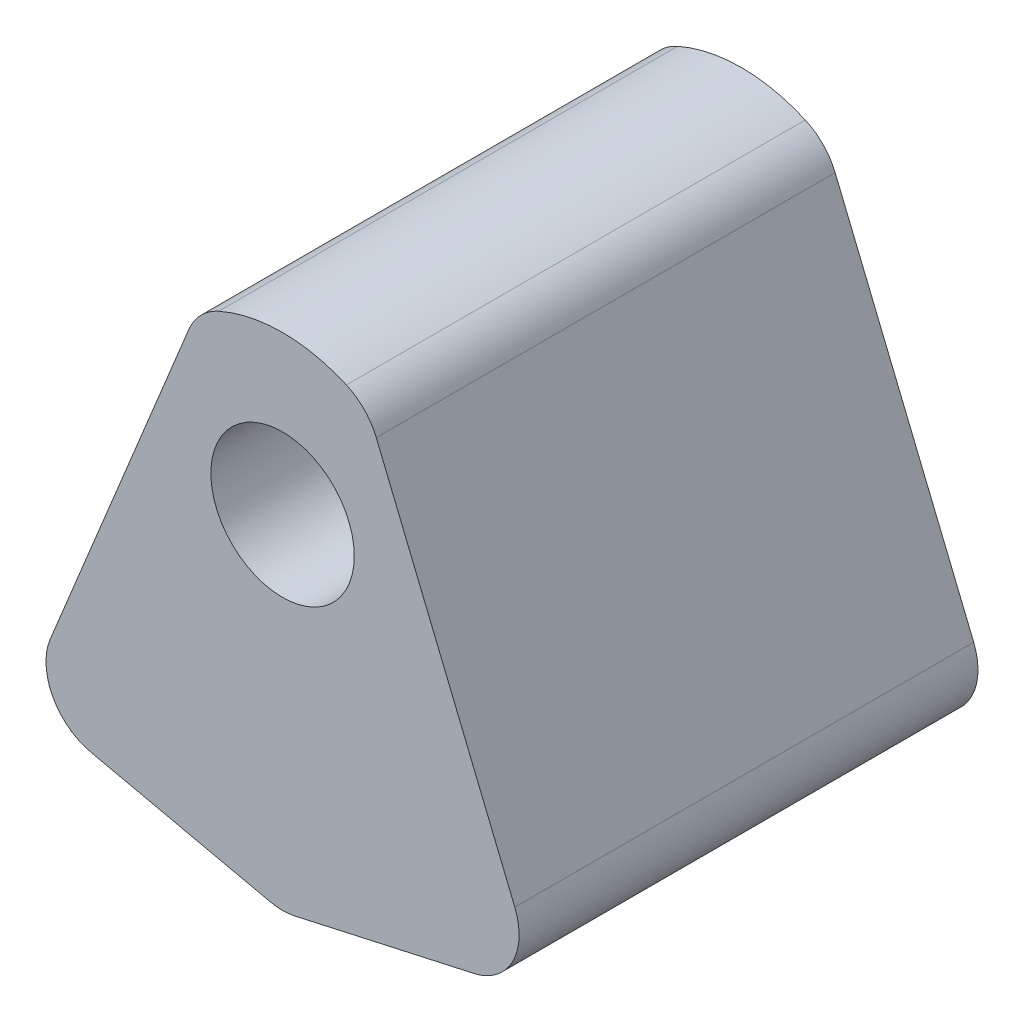
ISO-10303-21;
HEADER;
FILE_DESCRIPTION(('STEP AP214'),'2;1');
FILE_NAME('part.step','',(''),(''),'','','');
FILE_SCHEMA(('AUTOMOTIVE_DESIGN { 1 0 10303 214 1 1 1 1 }'));
ENDSEC;
DATA;
#1=APPLICATION_CONTEXT('core data for automotive mechanical design processes');
#2=APPLICATION_PROTOCOL_DEFINITION('international standard','automotive_design',2000,#1);
#3=PRODUCT_CONTEXT('',#1,'mechanical');
#4=PRODUCT('Part','Part','',(#3));
#5=PRODUCT_RELATED_PRODUCT_CATEGORY('part','',(#4));
#6=PRODUCT_DEFINITION_FORMATION('','',#4);
#7=PRODUCT_DEFINITION_CONTEXT('part definition',#1,'design');
#8=PRODUCT_DEFINITION('design','',#6,#7);
#9=PRODUCT_DEFINITION_SHAPE('','',#8);
#10=(LENGTH_UNIT() NAMED_UNIT(*) SI_UNIT(.MILLI.,.METRE.));
#11=(NAMED_UNIT(*) PLANE_ANGLE_UNIT() SI_UNIT($,.RADIAN.));
#12=(NAMED_UNIT(*) SI_UNIT($,.STERADIAN.) SOLID_ANGLE_UNIT());
#13=UNCERTAINTY_MEASURE_WITH_UNIT(LENGTH_MEASURE(1.E-05),#10,'distance_accuracy_value','');
#14=(GEOMETRIC_REPRESENTATION_CONTEXT(3) GLOBAL_UNCERTAINTY_ASSIGNED_CONTEXT((#13)) GLOBAL_UNIT_ASSIGNED_CONTEXT((#10,
#11,#12)) REPRESENTATION_CONTEXT('',''));
#15=CARTESIAN_POINT('',(0.,0.,0.));
#16=DIRECTION('',(0.,0.,1.));
#17=DIRECTION('',(1.,0.,0.));
#18=AXIS2_PLACEMENT_3D('',#15,#16,#17);
#19=CARTESIAN_POINT('',(3.12384371295259,1.71858132035534,8.));
#20=DIRECTION('',(0.,0.,-1.));
#21=DIRECTION('',(-1.,0.,0.));
#22=AXIS2_PLACEMENT_3D('',#19,#20,#21);
#23=PLANE('',#22);
#24=CARTESIAN_POINT('',(3.12384371295259,1.71858132035534,8.));
#25=DIRECTION('',(0.,0.,1.));
#26=DIRECTION('',(-1.,0.,0.));
#27=AXIS2_PLACEMENT_3D('',#24,#25,#26);
#28=CIRCLE('',#27,1.);
#29=CARTESIAN_POINT('',(3.34077417077124,0.742394260171387,8.));
#30=VERTEX_POINT('',#29);
#31=CARTESIAN_POINT('',(4.04887336974512,2.09847621905011,8.));
#32=VERTEX_POINT('',#31);
#33=EDGE_CURVE('E171',#30,#32,#28,.T.);
#34=ORIENTED_EDGE('',*,*,#33,.T.);
#35=DIRECTION('',(-0.37989489869476,0.925029656792526,0.));
#36=VECTOR('',#35,1.);
#37=CARTESIAN_POINT('',(4.04887336974512,2.09847621905011,8.));
#38=LINE('',#37,#36);
#39=CARTESIAN_POINT('',(1.63337237614125,7.98012944148705,8.));
#40=VERTEX_POINT('',#39);
#41=EDGE_CURVE('E109',#32,#40,#38,.T.);
#42=ORIENTED_EDGE('',*,*,#41,.T.);
#43=CARTESIAN_POINT('',(0.708342719348724,7.60023454279229,8.));
#44=DIRECTION('',(0.,0.,1.));
#45=DIRECTION('',(-1.,0.,0.));
#46=AXIS2_PLACEMENT_3D('',#43,#44,#45);
#47=CIRCLE('',#46,1.);
#48=CARTESIAN_POINT('',(1.113109987548,8.51465428153074,8.));
#49=VERTEX_POINT('',#48);
#50=EDGE_CURVE('E192',#40,#49,#47,.T.);
#51=ORIENTED_EDGE('',*,*,#50,.T.);
#52=CARTESIAN_POINT('',(0.,6.,8.));
#53=DIRECTION('',(0.,0.,1.));
#54=DIRECTION('',(1.,0.,0.));
#55=AXIS2_PLACEMENT_3D('',#52,#53,#54);
#56=CIRCLE('',#55,2.75);
#57=CARTESIAN_POINT('',(-1.113109987548,8.51465428153074,8.));
#58=VERTEX_POINT('',#57);
#59=EDGE_CURVE('E211',#49,#58,#56,.T.);
#60=ORIENTED_EDGE('',*,*,#59,.T.);
#61=CARTESIAN_POINT('',(-0.708342719348724,7.60023454279229,8.));
#62=DIRECTION('',(0.,0.,1.));
#63=DIRECTION('',(1.,0.,0.));
#64=AXIS2_PLACEMENT_3D('',#61,#62,#63);
#65=CIRCLE('',#64,1.);
#66=CARTESIAN_POINT('',(-1.63337237614125,7.98012944148705,8.));
#67=VERTEX_POINT('',#66);
#68=EDGE_CURVE('E208',#58,#67,#65,.T.);
#69=ORIENTED_EDGE('',*,*,#68,.T.);
#70=DIRECTION('',(-0.37989489869476,-0.925029656792526,0.));
#71=VECTOR('',#70,1.);
#72=CARTESIAN_POINT('',(-4.04887336974512,2.09847621905011,8.));
#73=LINE('',#72,#71);
#74=CARTESIAN_POINT('',(-4.04887336974512,2.09847621905011,8.));
#75=VERTEX_POINT('',#74);
#76=EDGE_CURVE('E210',#67,#75,#73,.T.);
#77=ORIENTED_EDGE('',*,*,#76,.T.);
#78=CARTESIAN_POINT('',(-3.12384371295259,1.71858132035534,8.));
#79=DIRECTION('',(0.,0.,1.));
#80=DIRECTION('',(-1.,0.,0.));
#81=AXIS2_PLACEMENT_3D('',#78,#79,#80);
#82=CIRCLE('',#81,1.);
#83=CARTESIAN_POINT('',(-3.34077417077124,0.742394260171387,8.));
#84=VERTEX_POINT('',#83);
#85=EDGE_CURVE('E134',#75,#84,#82,.T.);
#86=ORIENTED_EDGE('',*,*,#85,.T.);
#87=DIRECTION('',(0.976187060183953,-0.216930457818656,0.));
#88=VECTOR('',#87,1.);
#89=CARTESIAN_POINT('',(-0.21693045781866,0.0482067684041466,8.));
#90=LINE('',#89,#88);
#91=CARTESIAN_POINT('',(-0.21693045781866,0.0482067684041466,8.));
#92=VERTEX_POINT('',#91);
#93=EDGE_CURVE('E128',#84,#92,#90,.T.);
#94=ORIENTED_EDGE('',*,*,#93,.T.);
#95=CARTESIAN_POINT('',(0.,1.0243938285881,8.));
#96=DIRECTION('',(0.,0.,1.));
#97=DIRECTION('',(-1.,0.,0.));
#98=AXIS2_PLACEMENT_3D('',#95,#96,#97);
#99=CIRCLE('',#98,1.);
#100=CARTESIAN_POINT('',(0.21693045781866,0.0482067684041467,8.));
#101=VERTEX_POINT('',#100);
#102=EDGE_CURVE('E132',#92,#101,#99,.T.);
#103=ORIENTED_EDGE('',*,*,#102,.T.);
#104=DIRECTION('',(0.976187060183953,0.216930457818656,0.));
#105=VECTOR('',#104,1.);
#106=CARTESIAN_POINT('',(0.21693045781866,0.0482067684041466,8.));
#107=LINE('',#106,#105);
#108=EDGE_CURVE('E60',#101,#30,#107,.T.);
#109=ORIENTED_EDGE('',*,*,#108,.T.);
#110=EDGE_LOOP('',(#34,#42,#51,#60,#69,#77,#86,#94,#103,#109));
#111=FACE_BOUND('',#110,.T.);
#112=CARTESIAN_POINT('',(0.,6.,8.));
#113=DIRECTION('',(0.,0.,1.));
#114=DIRECTION('',(1.,0.,0.));
#115=AXIS2_PLACEMENT_3D('',#112,#113,#114);
#116=CIRCLE('',#115,1.25);
#117=CARTESIAN_POINT('',(1.25,6.,8.));
#118=VERTEX_POINT('',#117);
#119=EDGE_CURVE('E156',#118,#118,#116,.T.);
#120=ORIENTED_EDGE('',*,*,#119,.F.);
#121=EDGE_LOOP('',(#120));
#122=FACE_BOUND('',#121,.T.);
#123=ADVANCED_FACE('F43',(#111,#122),#23,.F.);
#124=CARTESIAN_POINT('',(3.12384371295259,1.71858132035534,0.));
#125=DIRECTION('',(0.,0.,-1.));
#126=DIRECTION('',(-1.,0.,0.));
#127=AXIS2_PLACEMENT_3D('',#124,#125,#126);
#128=PLANE('',#127);
#129=CARTESIAN_POINT('',(3.12384371295259,1.71858132035534,0.));
#130=DIRECTION('',(0.,0.,1.));
#131=DIRECTION('',(-1.,0.,0.));
#132=AXIS2_PLACEMENT_3D('',#129,#130,#131);
#133=CIRCLE('',#132,1.);
#134=CARTESIAN_POINT('',(3.34077417077124,0.742394260171387,0.));
#135=VERTEX_POINT('',#134);
#136=CARTESIAN_POINT('',(4.04887336974512,2.09847621905011,0.));
#137=VERTEX_POINT('',#136);
#138=EDGE_CURVE('E152',#135,#137,#133,.T.);
#139=ORIENTED_EDGE('',*,*,#138,.F.);
#140=DIRECTION('',(0.976187060183953,0.216930457818656,0.));
#141=VECTOR('',#140,1.);
#142=CARTESIAN_POINT('',(0.21693045781866,0.0482067684041466,0.));
#143=LINE('',#142,#141);
#144=CARTESIAN_POINT('',(0.21693045781866,0.0482067684041467,0.));
#145=VERTEX_POINT('',#144);
#146=EDGE_CURVE('E101',#145,#135,#143,.T.);
#147=ORIENTED_EDGE('',*,*,#146,.F.);
#148=CARTESIAN_POINT('',(0.,1.0243938285881,0.));
#149=DIRECTION('',(0.,0.,1.));
#150=DIRECTION('',(-1.,0.,0.));
#151=AXIS2_PLACEMENT_3D('',#148,#149,#150);
#152=CIRCLE('',#151,1.);
#153=CARTESIAN_POINT('',(-0.21693045781866,0.0482067684041466,0.));
#154=VERTEX_POINT('',#153);
#155=EDGE_CURVE('E95',#154,#145,#152,.T.);
#156=ORIENTED_EDGE('',*,*,#155,.F.);
#157=DIRECTION('',(0.976187060183953,-0.216930457818656,0.));
#158=VECTOR('',#157,1.);
#159=CARTESIAN_POINT('',(-0.21693045781866,0.0482067684041466,0.));
#160=LINE('',#159,#158);
#161=CARTESIAN_POINT('',(-3.34077417077124,0.742394260171387,0.));
#162=VERTEX_POINT('',#161);
#163=EDGE_CURVE('E142',#162,#154,#160,.T.);
#164=ORIENTED_EDGE('',*,*,#163,.F.);
#165=CARTESIAN_POINT('',(-3.12384371295259,1.71858132035534,0.));
#166=DIRECTION('',(0.,0.,1.));
#167=DIRECTION('',(-1.,0.,0.));
#168=AXIS2_PLACEMENT_3D('',#165,#166,#167);
#169=CIRCLE('',#168,1.);
#170=CARTESIAN_POINT('',(-4.04887336974512,2.09847621905011,0.));
#171=VERTEX_POINT('',#170);
#172=EDGE_CURVE('E166',#171,#162,#169,.T.);
#173=ORIENTED_EDGE('',*,*,#172,.F.);
#174=DIRECTION('',(-0.37989489869476,-0.925029656792526,0.));
#175=VECTOR('',#174,1.);
#176=CARTESIAN_POINT('',(-4.04887336974512,2.09847621905011,0.));
#177=LINE('',#176,#175);
#178=CARTESIAN_POINT('',(-1.63337237614125,7.98012944148705,0.));
#179=VERTEX_POINT('',#178);
#180=EDGE_CURVE('E164',#179,#171,#177,.T.);
#181=ORIENTED_EDGE('',*,*,#180,.F.);
#182=CARTESIAN_POINT('',(-0.708342719348724,7.60023454279229,0.));
#183=DIRECTION('',(0.,0.,1.));
#184=DIRECTION('',(1.,0.,0.));
#185=AXIS2_PLACEMENT_3D('',#182,#183,#184);
#186=CIRCLE('',#185,1.);
#187=CARTESIAN_POINT('',(-1.113109987548,8.51465428153074,0.));
#188=VERTEX_POINT('',#187);
#189=EDGE_CURVE('E162',#188,#179,#186,.T.);
#190=ORIENTED_EDGE('',*,*,#189,.F.);
#191=CARTESIAN_POINT('',(0.,6.,0.));
#192=DIRECTION('',(0.,0.,1.));
#193=DIRECTION('',(1.,0.,0.));
#194=AXIS2_PLACEMENT_3D('',#191,#192,#193);
#195=CIRCLE('',#194,2.75);
#196=CARTESIAN_POINT('',(1.113109987548,8.51465428153074,0.));
#197=VERTEX_POINT('',#196);
#198=EDGE_CURVE('E160',#197,#188,#195,.T.);
#199=ORIENTED_EDGE('',*,*,#198,.F.);
#200=CARTESIAN_POINT('',(0.708342719348724,7.60023454279229,0.));
#201=DIRECTION('',(0.,0.,1.));
#202=DIRECTION('',(-1.,0.,0.));
#203=AXIS2_PLACEMENT_3D('',#200,#201,#202);
#204=CIRCLE('',#203,1.);
#205=CARTESIAN_POINT('',(1.63337237614125,7.98012944148705,0.));
#206=VERTEX_POINT('',#205);
#207=EDGE_CURVE('E158',#206,#197,#204,.T.);
#208=ORIENTED_EDGE('',*,*,#207,.F.);
#209=DIRECTION('',(-0.37989489869476,0.925029656792526,0.));
#210=VECTOR('',#209,1.);
#211=CARTESIAN_POINT('',(4.04887336974512,2.09847621905011,0.));
#212=LINE('',#211,#210);
#213=EDGE_CURVE('E155',#137,#206,#212,.T.);
#214=ORIENTED_EDGE('',*,*,#213,.F.);
#215=EDGE_LOOP('',(#139,#147,#156,#164,#173,#181,#190,#199,#208,#214));
#216=FACE_BOUND('',#215,.T.);
#217=CARTESIAN_POINT('',(0.,6.,0.));
#218=DIRECTION('',(0.,0.,1.));
#219=DIRECTION('',(1.,0.,0.));
#220=AXIS2_PLACEMENT_3D('',#217,#218,#219);
#221=CIRCLE('',#220,1.25);
#222=CARTESIAN_POINT('',(1.25,6.,0.));
#223=VERTEX_POINT('',#222);
#224=EDGE_CURVE('E219',#223,#223,#221,.T.);
#225=ORIENTED_EDGE('',*,*,#224,.T.);
#226=EDGE_LOOP('',(#225));
#227=FACE_BOUND('',#226,.T.);
#228=ADVANCED_FACE('F196',(#216,#227),#128,.T.);
#229=CARTESIAN_POINT('',(3.12384371295259,1.71858132035534,8.));
#230=DIRECTION('',(0.,0.,-1.));
#231=DIRECTION('',(-1.,0.,0.));
#232=AXIS2_PLACEMENT_3D('',#229,#230,#231);
#233=CYLINDRICAL_SURFACE('',#232,1.);
#234=ORIENTED_EDGE('',*,*,#138,.T.);
#235=DIRECTION('',(0.,0.,-1.));
#236=VECTOR('',#235,1.);
#237=CARTESIAN_POINT('',(4.04887336974512,2.09847621905011,8.));
#238=LINE('',#237,#236);
#239=EDGE_CURVE('E13',#32,#137,#238,.T.);
#240=ORIENTED_EDGE('',*,*,#239,.F.);
#241=ORIENTED_EDGE('',*,*,#33,.F.);
#242=DIRECTION('',(0.,0.,-1.));
#243=VECTOR('',#242,1.);
#244=CARTESIAN_POINT('',(3.34077417077124,0.742394260171387,8.));
#245=LINE('',#244,#243);
#246=EDGE_CURVE('E148',#30,#135,#245,.T.);
#247=ORIENTED_EDGE('',*,*,#246,.T.);
#248=EDGE_LOOP('',(#234,#240,#241,#247));
#249=FACE_BOUND('',#248,.T.);
#250=ADVANCED_FACE('F45',(#249),#233,.T.);
#251=CARTESIAN_POINT('',(4.04887336974512,2.09847621905011,8.));
#252=DIRECTION('',(-0.925029656792526,-0.37989489869476,0.));
#253=DIRECTION('',(0.37989489869476,-0.925029656792526,0.));
#254=AXIS2_PLACEMENT_3D('',#251,#252,#253);
#255=PLANE('',#254);
#256=ORIENTED_EDGE('',*,*,#213,.T.);
#257=DIRECTION('',(0.,0.,-1.));
#258=VECTOR('',#257,1.);
#259=CARTESIAN_POINT('',(1.63337237614125,7.98012944148705,8.));
#260=LINE('',#259,#258);
#261=EDGE_CURVE('E52',#40,#206,#260,.T.);
#262=ORIENTED_EDGE('',*,*,#261,.F.);
#263=ORIENTED_EDGE('',*,*,#41,.F.);
#264=ORIENTED_EDGE('',*,*,#239,.T.);
#265=EDGE_LOOP('',(#256,#262,#263,#264));
#266=FACE_BOUND('',#265,.T.);
#267=ADVANCED_FACE('F255',(#266),#255,.F.);
#268=CARTESIAN_POINT('',(0.708342719348724,7.60023454279229,8.));
#269=DIRECTION('',(0.,0.,-1.));
#270=DIRECTION('',(-1.,0.,0.));
#271=AXIS2_PLACEMENT_3D('',#268,#269,#270);
#272=CYLINDRICAL_SURFACE('',#271,1.);
#273=ORIENTED_EDGE('',*,*,#207,.T.);
#274=DIRECTION('',(0.,0.,-1.));
#275=VECTOR('',#274,1.);
#276=CARTESIAN_POINT('',(1.113109987548,8.51465428153074,8.));
#277=LINE('',#276,#275);
#278=EDGE_CURVE('E184',#49,#197,#277,.T.);
#279=ORIENTED_EDGE('',*,*,#278,.F.);
#280=ORIENTED_EDGE('',*,*,#50,.F.);
#281=ORIENTED_EDGE('',*,*,#261,.T.);
#282=EDGE_LOOP('',(#273,#279,#280,#281));
#283=FACE_BOUND('',#282,.T.);
#284=ADVANCED_FACE('F190',(#283),#272,.T.);
#285=CARTESIAN_POINT('',(0.,6.,8.));
#286=DIRECTION('',(0.,0.,-1.));
#287=DIRECTION('',(-1.,0.,0.));
#288=AXIS2_PLACEMENT_3D('',#285,#286,#287);
#289=CYLINDRICAL_SURFACE('',#288,2.75);
#290=ORIENTED_EDGE('',*,*,#198,.T.);
#291=DIRECTION('',(0.,0.,-1.));
#292=VECTOR('',#291,1.);
#293=CARTESIAN_POINT('',(-1.113109987548,8.51465428153074,8.));
#294=LINE('',#293,#292);
#295=EDGE_CURVE('E181',#58,#188,#294,.T.);
#296=ORIENTED_EDGE('',*,*,#295,.F.);
#297=ORIENTED_EDGE('',*,*,#59,.F.);
#298=ORIENTED_EDGE('',*,*,#278,.T.);
#299=EDGE_LOOP('',(#290,#296,#297,#298));
#300=FACE_BOUND('',#299,.T.);
#301=ADVANCED_FACE('F202',(#300),#289,.T.);
#302=CARTESIAN_POINT('',(-0.708342719348724,7.60023454279229,8.));
#303=DIRECTION('',(0.,0.,-1.));
#304=DIRECTION('',(-1.,0.,0.));
#305=AXIS2_PLACEMENT_3D('',#302,#303,#304);
#306=CYLINDRICAL_SURFACE('',#305,1.);
#307=ORIENTED_EDGE('',*,*,#189,.T.);
#308=DIRECTION('',(0.,0.,-1.));
#309=VECTOR('',#308,1.);
#310=CARTESIAN_POINT('',(-1.63337237614125,7.98012944148705,8.));
#311=LINE('',#310,#309);
#312=EDGE_CURVE('E178',#67,#179,#311,.T.);
#313=ORIENTED_EDGE('',*,*,#312,.F.);
#314=ORIENTED_EDGE('',*,*,#68,.F.);
#315=ORIENTED_EDGE('',*,*,#295,.T.);
#316=EDGE_LOOP('',(#307,#313,#314,#315));
#317=FACE_BOUND('',#316,.T.);
#318=ADVANCED_FACE('F206',(#317),#306,.T.);
#319=CARTESIAN_POINT('',(-4.04887336974512,2.09847621905011,8.));
#320=DIRECTION('',(0.925029656792526,-0.37989489869476,0.));
#321=DIRECTION('',(0.37989489869476,0.925029656792526,0.));
#322=AXIS2_PLACEMENT_3D('',#319,#320,#321);
#323=PLANE('',#322);
#324=ORIENTED_EDGE('',*,*,#180,.T.);
#325=DIRECTION('',(0.,0.,-1.));
#326=VECTOR('',#325,1.);
#327=CARTESIAN_POINT('',(-4.04887336974512,2.09847621905011,8.));
#328=LINE('',#327,#326);
#329=EDGE_CURVE('E175',#75,#171,#328,.T.);
#330=ORIENTED_EDGE('',*,*,#329,.F.);
#331=ORIENTED_EDGE('',*,*,#76,.F.);
#332=ORIENTED_EDGE('',*,*,#312,.T.);
#333=EDGE_LOOP('',(#324,#330,#331,#332));
#334=FACE_BOUND('',#333,.T.);
#335=ADVANCED_FACE('F245',(#334),#323,.F.);
#336=CARTESIAN_POINT('',(-3.12384371295259,1.71858132035534,8.));
#337=DIRECTION('',(0.,0.,-1.));
#338=DIRECTION('',(-1.,0.,0.));
#339=AXIS2_PLACEMENT_3D('',#336,#337,#338);
#340=CYLINDRICAL_SURFACE('',#339,1.);
#341=ORIENTED_EDGE('',*,*,#172,.T.);
#342=DIRECTION('',(0.,0.,-1.));
#343=VECTOR('',#342,1.);
#344=CARTESIAN_POINT('',(-3.34077417077124,0.742394260171387,8.));
#345=LINE('',#344,#343);
#346=EDGE_CURVE('E143',#84,#162,#345,.T.);
#347=ORIENTED_EDGE('',*,*,#346,.F.);
#348=ORIENTED_EDGE('',*,*,#85,.F.);
#349=ORIENTED_EDGE('',*,*,#329,.T.);
#350=EDGE_LOOP('',(#341,#347,#348,#349));
#351=FACE_BOUND('',#350,.T.);
#352=ADVANCED_FACE('F242',(#351),#340,.T.);
#353=CARTESIAN_POINT('',(-0.21693045781866,0.0482067684041466,8.));
#354=DIRECTION('',(0.216930457818656,0.976187060183953,0.));
#355=DIRECTION('',(-0.976187060183953,0.216930457818656,0.));
#356=AXIS2_PLACEMENT_3D('',#353,#354,#355);
#357=PLANE('',#356);
#358=ORIENTED_EDGE('',*,*,#163,.T.);
#359=DIRECTION('',(0.,0.,-1.));
#360=VECTOR('',#359,1.);
#361=CARTESIAN_POINT('',(-0.21693045781866,0.0482067684041466,8.));
#362=LINE('',#361,#360);
#363=EDGE_CURVE('E139',#92,#154,#362,.T.);
#364=ORIENTED_EDGE('',*,*,#363,.F.);
#365=ORIENTED_EDGE('',*,*,#93,.F.);
#366=ORIENTED_EDGE('',*,*,#346,.T.);
#367=EDGE_LOOP('',(#358,#364,#365,#366));
#368=FACE_BOUND('',#367,.T.);
#369=ADVANCED_FACE('F140',(#368),#357,.F.);
#370=CARTESIAN_POINT('',(0.,1.0243938285881,8.));
#371=DIRECTION('',(0.,0.,-1.));
#372=DIRECTION('',(-1.,0.,0.));
#373=AXIS2_PLACEMENT_3D('',#370,#371,#372);
#374=CYLINDRICAL_SURFACE('',#373,1.);
#375=ORIENTED_EDGE('',*,*,#155,.T.);
#376=DIRECTION('',(0.,0.,-1.));
#377=VECTOR('',#376,1.);
#378=CARTESIAN_POINT('',(0.21693045781866,0.0482067684041467,8.));
#379=LINE('',#378,#377);
#380=EDGE_CURVE('E144',#101,#145,#379,.T.);
#381=ORIENTED_EDGE('',*,*,#380,.F.);
#382=ORIENTED_EDGE('',*,*,#102,.F.);
#383=ORIENTED_EDGE('',*,*,#363,.T.);
#384=EDGE_LOOP('',(#375,#381,#382,#383));
#385=FACE_BOUND('',#384,.T.);
#386=ADVANCED_FACE('F146',(#385),#374,.T.);
#387=CARTESIAN_POINT('',(0.21693045781866,0.0482067684041466,8.));
#388=DIRECTION('',(-0.216930457818656,0.976187060183953,0.));
#389=DIRECTION('',(-0.976187060183953,-0.216930457818656,0.));
#390=AXIS2_PLACEMENT_3D('',#387,#388,#389);
#391=PLANE('',#390);
#392=ORIENTED_EDGE('',*,*,#146,.T.);
#393=ORIENTED_EDGE('',*,*,#246,.F.);
#394=ORIENTED_EDGE('',*,*,#108,.F.);
#395=ORIENTED_EDGE('',*,*,#380,.T.);
#396=EDGE_LOOP('',(#392,#393,#394,#395));
#397=FACE_BOUND('',#396,.T.);
#398=ADVANCED_FACE('F235',(#397),#391,.F.);
#399=CARTESIAN_POINT('',(0.,6.,8.));
#400=DIRECTION('',(0.,0.,-1.));
#401=DIRECTION('',(-1.,0.,0.));
#402=AXIS2_PLACEMENT_3D('',#399,#400,#401);
#403=CYLINDRICAL_SURFACE('',#402,1.25);
#404=ORIENTED_EDGE('',*,*,#119,.T.);
#405=EDGE_LOOP('',(#404));
#406=FACE_BOUND('',#405,.T.);
#407=ORIENTED_EDGE('',*,*,#224,.F.);
#408=EDGE_LOOP('',(#407));
#409=FACE_BOUND('',#408,.T.);
#410=ADVANCED_FACE('F225',(#406,#409),#403,.F.);
#411=CLOSED_SHELL('',(#123,#228,#250,#267,#284,#301,#318,#335,#352,#369,#386,#398,#410));
#412=MANIFOLD_SOLID_BREP('B2',#411);
#413=ADVANCED_BREP_SHAPE_REPRESENTATION('',(#18,#412),#14);
#414=SHAPE_DEFINITION_REPRESENTATION(#9,#413);
ENDSEC;
END-ISO-10303-21;
